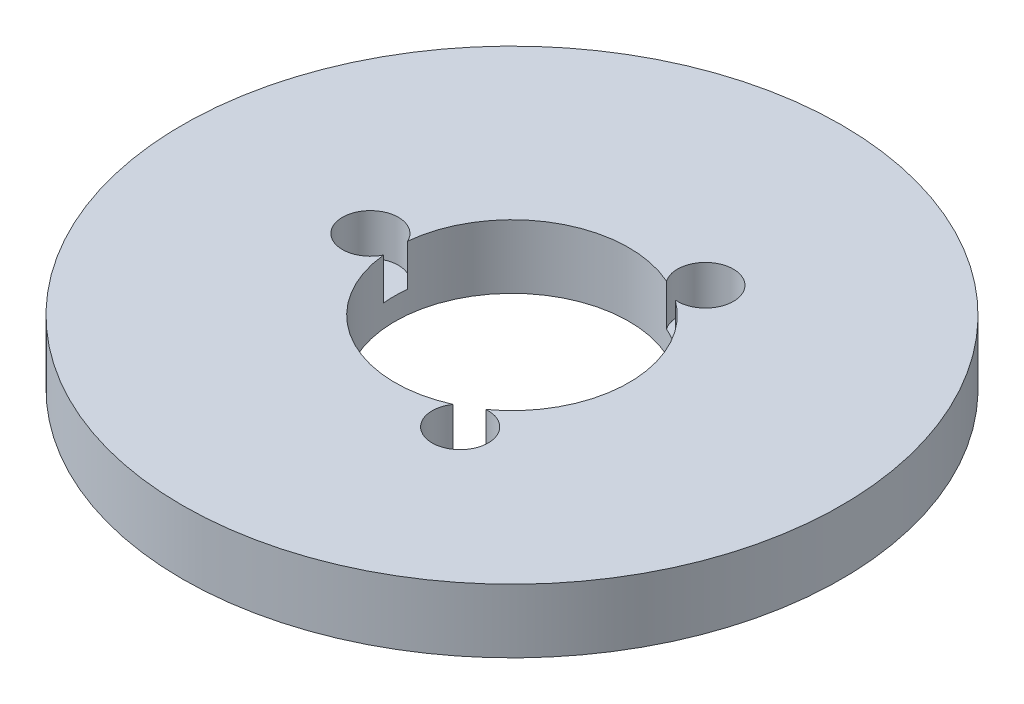
ISO-10303-21;
HEADER;
FILE_DESCRIPTION(('STEP AP214'),'2;1');
FILE_NAME('part.step','',(''),(''),'','','');
FILE_SCHEMA(('AUTOMOTIVE_DESIGN { 1 0 10303 214 1 1 1 1 }'));
ENDSEC;
DATA;
#1=APPLICATION_CONTEXT('core data for automotive mechanical design processes');
#2=APPLICATION_PROTOCOL_DEFINITION('international standard','automotive_design',2000,#1);
#3=PRODUCT_CONTEXT('',#1,'mechanical');
#4=PRODUCT('Part','Part','',(#3));
#5=PRODUCT_RELATED_PRODUCT_CATEGORY('part','',(#4));
#6=PRODUCT_DEFINITION_FORMATION('','',#4);
#7=PRODUCT_DEFINITION_CONTEXT('part definition',#1,'design');
#8=PRODUCT_DEFINITION('design','',#6,#7);
#9=PRODUCT_DEFINITION_SHAPE('','',#8);
#10=(LENGTH_UNIT() NAMED_UNIT(*) SI_UNIT(.MILLI.,.METRE.));
#11=(NAMED_UNIT(*) PLANE_ANGLE_UNIT() SI_UNIT($,.RADIAN.));
#12=(NAMED_UNIT(*) SI_UNIT($,.STERADIAN.) SOLID_ANGLE_UNIT());
#13=UNCERTAINTY_MEASURE_WITH_UNIT(LENGTH_MEASURE(1.E-05),#10,'distance_accuracy_value','');
#14=(GEOMETRIC_REPRESENTATION_CONTEXT(3) GLOBAL_UNCERTAINTY_ASSIGNED_CONTEXT((#13)) GLOBAL_UNIT_ASSIGNED_CONTEXT((#10,
#11,#12)) REPRESENTATION_CONTEXT('',''));
#15=CARTESIAN_POINT('',(0.,0.,0.));
#16=DIRECTION('',(0.,0.,1.));
#17=DIRECTION('',(1.,0.,0.));
#18=AXIS2_PLACEMENT_3D('',#15,#16,#17);
#19=CARTESIAN_POINT('',(0.,15.,0.));
#20=DIRECTION('',(0.,-1.,0.));
#21=DIRECTION('',(0.,0.,-1.));
#22=AXIS2_PLACEMENT_3D('',#19,#20,#21);
#23=CYLINDRICAL_SURFACE('',#22,77.5);
#24=CARTESIAN_POINT('',(0.,15.,0.));
#25=DIRECTION('',(0.,1.,0.));
#26=DIRECTION('',(0.,0.,1.));
#27=AXIS2_PLACEMENT_3D('',#24,#25,#26);
#28=CIRCLE('',#27,77.5);
#29=CARTESIAN_POINT('',(0.,15.,77.5));
#30=VERTEX_POINT('',#29);
#31=EDGE_CURVE('E126',#30,#30,#28,.T.);
#32=ORIENTED_EDGE('',*,*,#31,.F.);
#33=EDGE_LOOP('',(#32));
#34=FACE_BOUND('',#33,.T.);
#35=CARTESIAN_POINT('',(0.,0.,0.));
#36=DIRECTION('',(0.,1.,0.));
#37=DIRECTION('',(0.,0.,1.));
#38=AXIS2_PLACEMENT_3D('',#35,#36,#37);
#39=CIRCLE('',#38,77.5);
#40=CARTESIAN_POINT('',(0.,0.,77.5));
#41=VERTEX_POINT('',#40);
#42=EDGE_CURVE('E124',#41,#41,#39,.T.);
#43=ORIENTED_EDGE('',*,*,#42,.T.);
#44=EDGE_LOOP('',(#43));
#45=FACE_BOUND('',#44,.T.);
#46=ADVANCED_FACE('F39',(#34,#45),#23,.T.);
#47=CARTESIAN_POINT('',(0.,15.,0.));
#48=DIRECTION('',(0.,1.,0.));
#49=DIRECTION('',(0.,0.,1.));
#50=AXIS2_PLACEMENT_3D('',#47,#48,#49);
#51=PLANE('',#50);
#52=CARTESIAN_POINT('',(16.6481367889155,15.,28.835418769758));
#53=DIRECTION('',(0.,1.,0.));
#54=DIRECTION('',(0.866025403784436,0.,-0.500000000000004));
#55=AXIS2_PLACEMENT_3D('',#52,#53,#54);
#56=CIRCLE('',#55,6.58132679597109);
#57=CARTESIAN_POINT('',(11.2269055068956,15.,25.1039158845635));
#58=VERTEX_POINT('',#57);
#59=CARTESIAN_POINT('',(16.1271761370521,15.,22.2747433171406));
#60=VERTEX_POINT('',#59);
#61=EDGE_CURVE('E147',#58,#60,#56,.T.);
#62=ORIENTED_EDGE('',*,*,#61,.F.);
#63=CARTESIAN_POINT('',(0.,15.,0.));
#64=DIRECTION('',(0.,1.,0.));
#65=DIRECTION('',(0.,0.,1.));
#66=AXIS2_PLACEMENT_3D('',#63,#64,#65);
#67=CIRCLE('',#66,27.5);
#68=CARTESIAN_POINT('',(-27.3540816439474,15.,2.8291725674229));
#69=VERTEX_POINT('',#68);
#70=EDGE_CURVE('E118',#69,#58,#67,.T.);
#71=ORIENTED_EDGE('',*,*,#70,.F.);
#72=CARTESIAN_POINT('',(-33.2962735778308,15.,0.));
#73=DIRECTION('',(0.,1.,0.));
#74=DIRECTION('',(0.,0.,1.));
#75=AXIS2_PLACEMENT_3D('',#72,#73,#74);
#76=CIRCLE('',#75,6.58132679597109);
#77=CARTESIAN_POINT('',(-27.3540816439474,15.,-2.8291725674229));
#78=VERTEX_POINT('',#77);
#79=EDGE_CURVE('E113',#78,#69,#76,.T.);
#80=ORIENTED_EDGE('',*,*,#79,.F.);
#81=CARTESIAN_POINT('',(11.2269055068952,15.,-25.1039158845636));
#82=VERTEX_POINT('',#81);
#83=EDGE_CURVE('E106',#82,#78,#67,.T.);
#84=ORIENTED_EDGE('',*,*,#83,.F.);
#85=CARTESIAN_POINT('',(16.6481367889151,15.,-28.8354187697582));
#86=DIRECTION('',(0.,1.,0.));
#87=DIRECTION('',(-0.866025403784443,0.,-0.499999999999992));
#88=AXIS2_PLACEMENT_3D('',#85,#86,#87);
#89=CIRCLE('',#88,6.58132679597109);
#90=CARTESIAN_POINT('',(16.1271761370518,15.,-22.2747433171408));
#91=VERTEX_POINT('',#90);
#92=EDGE_CURVE('E90',#91,#82,#89,.T.);
#93=ORIENTED_EDGE('',*,*,#92,.F.);
#94=EDGE_CURVE('E116',#60,#91,#67,.T.);
#95=ORIENTED_EDGE('',*,*,#94,.F.);
#96=EDGE_LOOP('',(#62,#71,#80,#84,#93,#95));
#97=FACE_BOUND('',#96,.T.);
#98=ORIENTED_EDGE('',*,*,#31,.T.);
#99=EDGE_LOOP('',(#98));
#100=FACE_BOUND('',#99,.T.);
#101=ADVANCED_FACE('F115',(#97,#100),#51,.T.);
#102=CARTESIAN_POINT('',(0.,0.,0.));
#103=DIRECTION('',(0.,1.,0.));
#104=DIRECTION('',(0.,0.,1.));
#105=AXIS2_PLACEMENT_3D('',#102,#103,#104);
#106=PLANE('',#105);
#107=CARTESIAN_POINT('',(0.,0.,0.));
#108=DIRECTION('',(0.,1.,0.));
#109=DIRECTION('',(0.,0.,1.));
#110=AXIS2_PLACEMENT_3D('',#107,#108,#109);
#111=CIRCLE('',#110,27.5);
#112=CARTESIAN_POINT('',(0.,0.,27.5));
#113=VERTEX_POINT('',#112);
#114=EDGE_CURVE('E120',#113,#113,#111,.T.);
#115=ORIENTED_EDGE('',*,*,#114,.T.);
#116=EDGE_LOOP('',(#115));
#117=FACE_BOUND('',#116,.T.);
#118=ORIENTED_EDGE('',*,*,#42,.F.);
#119=EDGE_LOOP('',(#118));
#120=FACE_BOUND('',#119,.T.);
#121=ADVANCED_FACE('F164',(#117,#120),#106,.F.);
#122=CARTESIAN_POINT('',(0.,15.,0.));
#123=DIRECTION('',(0.,-1.,0.));
#124=DIRECTION('',(0.,0.,-1.));
#125=AXIS2_PLACEMENT_3D('',#122,#123,#124);
#126=CYLINDRICAL_SURFACE('',#125,27.5);
#127=DIRECTION('',(0.,1.,0.));
#128=VECTOR('',#127,1.);
#129=CARTESIAN_POINT('',(11.2269055068956,10.1130324288967,25.1039158845635));
#130=LINE('',#129,#128);
#131=CARTESIAN_POINT('',(11.2269055068956,5.22606485779335,25.1039158845635));
#132=VERTEX_POINT('',#131);
#133=EDGE_CURVE('E11',#132,#58,#130,.T.);
#134=ORIENTED_EDGE('',*,*,#133,.F.);
#135=CARTESIAN_POINT('',(0.,5.22606485779335,0.));
#136=DIRECTION('',(0.,1.,0.));
#137=DIRECTION('',(0.,0.,1.));
#138=AXIS2_PLACEMENT_3D('',#135,#136,#137);
#139=CIRCLE('',#138,27.5);
#140=CARTESIAN_POINT('',(16.1271761370521,5.22606485779335,22.2747433171406));
#141=VERTEX_POINT('',#140);
#142=EDGE_CURVE('E144',#132,#141,#139,.T.);
#143=ORIENTED_EDGE('',*,*,#142,.T.);
#144=DIRECTION('',(0.,1.,0.));
#145=VECTOR('',#144,1.);
#146=CARTESIAN_POINT('',(16.1271761370521,10.1130324288967,22.2747433171406));
#147=LINE('',#146,#145);
#148=EDGE_CURVE('E46',#60,#141,#147,.F.);
#149=ORIENTED_EDGE('',*,*,#148,.F.);
#150=ORIENTED_EDGE('',*,*,#94,.T.);
#151=DIRECTION('',(0.,1.,0.));
#152=VECTOR('',#151,1.);
#153=CARTESIAN_POINT('',(16.1271761370518,10.1130324288967,-22.2747433171408));
#154=LINE('',#153,#152);
#155=CARTESIAN_POINT('',(16.1271761370518,5.22606485779335,-22.2747433171408));
#156=VERTEX_POINT('',#155);
#157=EDGE_CURVE('E92',#156,#91,#154,.T.);
#158=ORIENTED_EDGE('',*,*,#157,.F.);
#159=CARTESIAN_POINT('',(0.,5.22606485779335,0.));
#160=DIRECTION('',(0.,1.,0.));
#161=DIRECTION('',(0.,0.,1.));
#162=AXIS2_PLACEMENT_3D('',#159,#160,#161);
#163=CIRCLE('',#162,27.5);
#164=CARTESIAN_POINT('',(11.2269055068952,5.22606485779335,-25.1039158845636));
#165=VERTEX_POINT('',#164);
#166=EDGE_CURVE('E107',#156,#165,#163,.T.);
#167=ORIENTED_EDGE('',*,*,#166,.T.);
#168=DIRECTION('',(0.,1.,0.));
#169=VECTOR('',#168,1.);
#170=CARTESIAN_POINT('',(11.2269055068952,10.1130324288967,-25.1039158845636));
#171=LINE('',#170,#169);
#172=EDGE_CURVE('E95',#82,#165,#171,.F.);
#173=ORIENTED_EDGE('',*,*,#172,.F.);
#174=ORIENTED_EDGE('',*,*,#83,.T.);
#175=DIRECTION('',(0.,1.,0.));
#176=VECTOR('',#175,1.);
#177=CARTESIAN_POINT('',(-27.3540816439474,10.1130324288967,-2.82917256742288));
#178=LINE('',#177,#176);
#179=CARTESIAN_POINT('',(-27.3540816439474,5.22606485779335,-2.8291725674229));
#180=VERTEX_POINT('',#179);
#181=EDGE_CURVE('E143',#180,#78,#178,.T.);
#182=ORIENTED_EDGE('',*,*,#181,.F.);
#183=CARTESIAN_POINT('',(0.,5.22606485779335,0.));
#184=DIRECTION('',(0.,1.,0.));
#185=DIRECTION('',(0.,0.,1.));
#186=AXIS2_PLACEMENT_3D('',#183,#184,#185);
#187=CIRCLE('',#186,27.5);
#188=CARTESIAN_POINT('',(-27.3540816439474,5.22606485779335,2.8291725674229));
#189=VERTEX_POINT('',#188);
#190=EDGE_CURVE('E132',#180,#189,#187,.T.);
#191=ORIENTED_EDGE('',*,*,#190,.T.);
#192=DIRECTION('',(0.,1.,0.));
#193=VECTOR('',#192,1.);
#194=CARTESIAN_POINT('',(-27.3540816439474,10.1130324288967,2.82917256742288));
#195=LINE('',#194,#193);
#196=EDGE_CURVE('E137',#69,#189,#195,.F.);
#197=ORIENTED_EDGE('',*,*,#196,.F.);
#198=ORIENTED_EDGE('',*,*,#70,.T.);
#199=EDGE_LOOP('',(#134,#143,#149,#150,#158,#167,#173,#174,#182,#191,#197,#198));
#200=FACE_BOUND('',#199,.T.);
#201=ORIENTED_EDGE('',*,*,#114,.F.);
#202=EDGE_LOOP('',(#201));
#203=FACE_BOUND('',#202,.T.);
#204=ADVANCED_FACE('F103',(#200,#203),#126,.F.);
#205=CARTESIAN_POINT('',(-33.2962735778308,5.22606485779335,0.));
#206=DIRECTION('',(0.,1.,0.));
#207=DIRECTION('',(0.,0.,1.));
#208=AXIS2_PLACEMENT_3D('',#205,#206,#207);
#209=CYLINDRICAL_SURFACE('',#208,6.58132679597109);
#210=ORIENTED_EDGE('',*,*,#181,.T.);
#211=ORIENTED_EDGE('',*,*,#79,.T.);
#212=ORIENTED_EDGE('',*,*,#196,.T.);
#213=CARTESIAN_POINT('',(-33.2962735778308,5.22606485779335,0.));
#214=DIRECTION('',(0.,1.,0.));
#215=DIRECTION('',(0.,0.,1.));
#216=AXIS2_PLACEMENT_3D('',#213,#214,#215);
#217=CIRCLE('',#216,6.58132679597109);
#218=EDGE_CURVE('E121',#180,#189,#217,.T.);
#219=ORIENTED_EDGE('',*,*,#218,.F.);
#220=EDGE_LOOP('',(#210,#211,#212,#219));
#221=FACE_BOUND('',#220,.T.);
#222=ADVANCED_FACE('F174',(#221),#209,.F.);
#223=CARTESIAN_POINT('',(-33.2962735778308,5.22606485779335,0.));
#224=DIRECTION('',(0.,1.,0.));
#225=DIRECTION('',(0.,0.,1.));
#226=AXIS2_PLACEMENT_3D('',#223,#224,#225);
#227=PLANE('',#226);
#228=ORIENTED_EDGE('',*,*,#218,.T.);
#229=ORIENTED_EDGE('',*,*,#190,.F.);
#230=EDGE_LOOP('',(#228,#229));
#231=FACE_BOUND('',#230,.T.);
#232=ADVANCED_FACE('F177',(#231),#227,.T.);
#233=CARTESIAN_POINT('',(16.6481367889151,5.22606485779335,-28.8354187697582));
#234=DIRECTION('',(0.,1.,0.));
#235=DIRECTION('',(0.,0.,1.));
#236=AXIS2_PLACEMENT_3D('',#233,#234,#235);
#237=CYLINDRICAL_SURFACE('',#236,6.58132679597109);
#238=ORIENTED_EDGE('',*,*,#157,.T.);
#239=ORIENTED_EDGE('',*,*,#92,.T.);
#240=ORIENTED_EDGE('',*,*,#172,.T.);
#241=CARTESIAN_POINT('',(16.6481367889151,5.22606485779335,-28.8354187697582));
#242=DIRECTION('',(0.,1.,0.));
#243=DIRECTION('',(-0.866025403784443,0.,-0.499999999999992));
#244=AXIS2_PLACEMENT_3D('',#241,#242,#243);
#245=CIRCLE('',#244,6.58132679597109);
#246=EDGE_CURVE('E56',#156,#165,#245,.T.);
#247=ORIENTED_EDGE('',*,*,#246,.F.);
#248=EDGE_LOOP('',(#238,#239,#240,#247));
#249=FACE_BOUND('',#248,.T.);
#250=ADVANCED_FACE('F93',(#249),#237,.F.);
#251=CARTESIAN_POINT('',(16.6481367889151,5.22606485779335,-28.8354187697582));
#252=DIRECTION('',(0.,1.,0.));
#253=DIRECTION('',(-0.866025403784443,0.,-0.499999999999992));
#254=AXIS2_PLACEMENT_3D('',#251,#252,#253);
#255=PLANE('',#254);
#256=ORIENTED_EDGE('',*,*,#246,.T.);
#257=ORIENTED_EDGE('',*,*,#166,.F.);
#258=EDGE_LOOP('',(#256,#257));
#259=FACE_BOUND('',#258,.T.);
#260=ADVANCED_FACE('F160',(#259),#255,.T.);
#261=CARTESIAN_POINT('',(16.6481367889155,5.22606485779335,28.835418769758));
#262=DIRECTION('',(0.,1.,0.));
#263=DIRECTION('',(0.,0.,1.));
#264=AXIS2_PLACEMENT_3D('',#261,#262,#263);
#265=CYLINDRICAL_SURFACE('',#264,6.58132679597109);
#266=ORIENTED_EDGE('',*,*,#133,.T.);
#267=ORIENTED_EDGE('',*,*,#61,.T.);
#268=ORIENTED_EDGE('',*,*,#148,.T.);
#269=CARTESIAN_POINT('',(16.6481367889155,5.22606485779335,28.835418769758));
#270=DIRECTION('',(0.,1.,0.));
#271=DIRECTION('',(0.866025403784436,0.,-0.500000000000004));
#272=AXIS2_PLACEMENT_3D('',#269,#270,#271);
#273=CIRCLE('',#272,6.58132679597109);
#274=EDGE_CURVE('E55',#132,#141,#273,.T.);
#275=ORIENTED_EDGE('',*,*,#274,.F.);
#276=EDGE_LOOP('',(#266,#267,#268,#275));
#277=FACE_BOUND('',#276,.T.);
#278=ADVANCED_FACE('F149',(#277),#265,.F.);
#279=CARTESIAN_POINT('',(16.6481367889155,5.22606485779335,28.835418769758));
#280=DIRECTION('',(0.,1.,0.));
#281=DIRECTION('',(0.866025403784436,0.,-0.500000000000004));
#282=AXIS2_PLACEMENT_3D('',#279,#280,#281);
#283=PLANE('',#282);
#284=ORIENTED_EDGE('',*,*,#274,.T.);
#285=ORIENTED_EDGE('',*,*,#142,.F.);
#286=EDGE_LOOP('',(#284,#285));
#287=FACE_BOUND('',#286,.T.);
#288=ADVANCED_FACE('F151',(#287),#283,.T.);
#289=CLOSED_SHELL('',(#46,#101,#121,#204,#222,#232,#250,#260,#278,#288));
#290=MANIFOLD_SOLID_BREP('B2',#289);
#291=ADVANCED_BREP_SHAPE_REPRESENTATION('',(#18,#290),#14);
#292=SHAPE_DEFINITION_REPRESENTATION(#9,#291);
ENDSEC;
END-ISO-10303-21;
